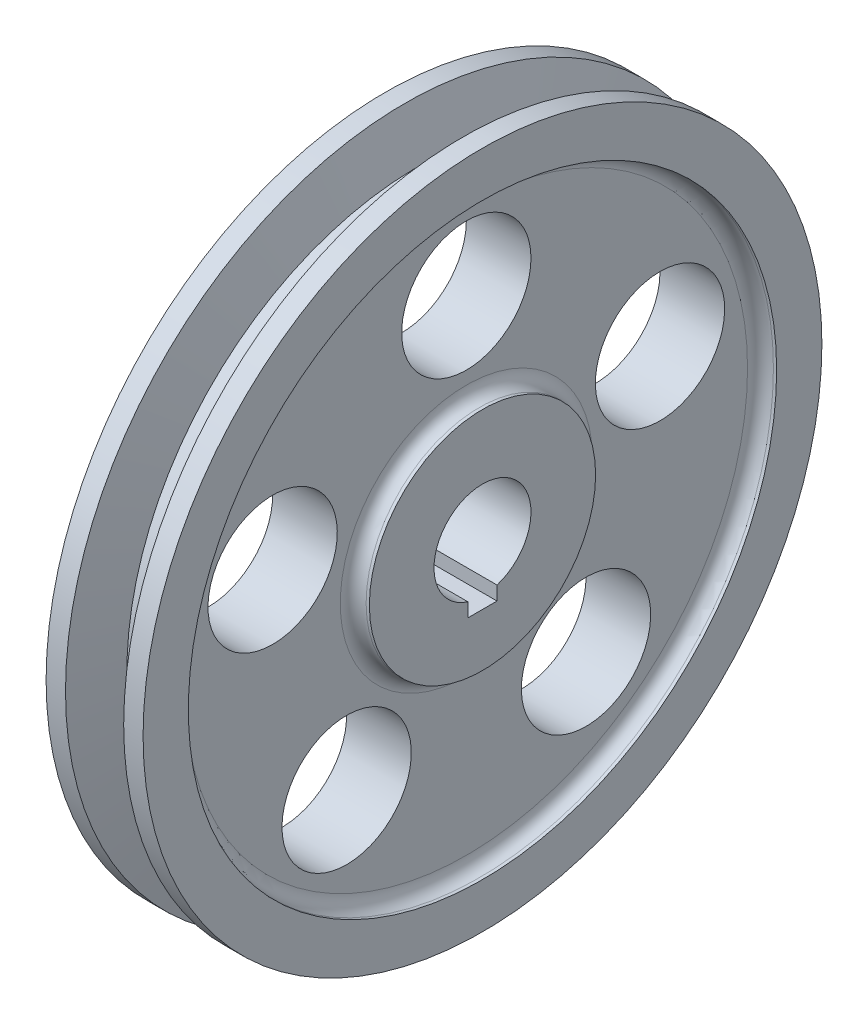
ISO-10303-21;
HEADER;
FILE_DESCRIPTION(('STEP AP214'),'2;1');
FILE_NAME('part.step','',(''),(''),'','','');
FILE_SCHEMA(('AUTOMOTIVE_DESIGN { 1 0 10303 214 1 1 1 1 }'));
ENDSEC;
DATA;
#1=APPLICATION_CONTEXT('core data for automotive mechanical design processes');
#2=APPLICATION_PROTOCOL_DEFINITION('international standard','automotive_design',2000,#1);
#3=PRODUCT_CONTEXT('',#1,'mechanical');
#4=PRODUCT('Part','Part','',(#3));
#5=PRODUCT_RELATED_PRODUCT_CATEGORY('part','',(#4));
#6=PRODUCT_DEFINITION_FORMATION('','',#4);
#7=PRODUCT_DEFINITION_CONTEXT('part definition',#1,'design');
#8=PRODUCT_DEFINITION('design','',#6,#7);
#9=PRODUCT_DEFINITION_SHAPE('','',#8);
#10=(LENGTH_UNIT() NAMED_UNIT(*) SI_UNIT(.MILLI.,.METRE.));
#11=(NAMED_UNIT(*) PLANE_ANGLE_UNIT() SI_UNIT($,.RADIAN.));
#12=(NAMED_UNIT(*) SI_UNIT($,.STERADIAN.) SOLID_ANGLE_UNIT());
#13=UNCERTAINTY_MEASURE_WITH_UNIT(LENGTH_MEASURE(1.E-05),#10,'distance_accuracy_value','');
#14=(GEOMETRIC_REPRESENTATION_CONTEXT(3) GLOBAL_UNCERTAINTY_ASSIGNED_CONTEXT((#13)) GLOBAL_UNIT_ASSIGNED_CONTEXT((#10,
#11,#12)) REPRESENTATION_CONTEXT('',''));
#15=CARTESIAN_POINT('',(0.,0.,0.));
#16=DIRECTION('',(0.,0.,1.));
#17=DIRECTION('',(1.,0.,0.));
#18=AXIS2_PLACEMENT_3D('',#15,#16,#17);
#19=CARTESIAN_POINT('',(-7.5,7.5,0.));
#20=DIRECTION('',(-1.,0.,0.));
#21=DIRECTION('',(0.,0.,1.));
#22=AXIS2_PLACEMENT_3D('',#19,#20,#21);
#23=PLANE('',#22);
#24=DIRECTION('',(0.,-1.,0.));
#25=VECTOR('',#24,1.);
#26=CARTESIAN_POINT('',(-7.5,-7.,2.25));
#27=LINE('',#26,#25);
#28=CARTESIAN_POINT('',(-7.5,-7.15454401062709,2.25));
#29=VERTEX_POINT('',#28);
#30=CARTESIAN_POINT('',(-7.5,-9.3,2.25));
#31=VERTEX_POINT('',#30);
#32=EDGE_CURVE('E50',#29,#31,#27,.T.);
#33=ORIENTED_EDGE('',*,*,#32,.T.);
#34=DIRECTION('',(0.,0.,-1.));
#35=VECTOR('',#34,1.);
#36=CARTESIAN_POINT('',(-7.5,-9.3,2.25));
#37=LINE('',#36,#35);
#38=CARTESIAN_POINT('',(-7.5,-9.3,-2.25));
#39=VERTEX_POINT('',#38);
#40=EDGE_CURVE('E74',#31,#39,#37,.T.);
#41=ORIENTED_EDGE('',*,*,#40,.T.);
#42=DIRECTION('',(0.,1.,0.));
#43=VECTOR('',#42,1.);
#44=CARTESIAN_POINT('',(-7.5,-7.,-2.25));
#45=LINE('',#44,#43);
#46=CARTESIAN_POINT('',(-7.5,-7.15454401062709,-2.25));
#47=VERTEX_POINT('',#46);
#48=EDGE_CURVE('E71',#39,#47,#45,.T.);
#49=ORIENTED_EDGE('',*,*,#48,.T.);
#50=CARTESIAN_POINT('',(-7.5,0.,0.));
#51=DIRECTION('',(1.,0.,0.));
#52=DIRECTION('',(0.,0.,-1.));
#53=AXIS2_PLACEMENT_3D('',#50,#51,#52);
#54=CIRCLE('',#53,7.5);
#55=EDGE_CURVE('E37',#47,#29,#54,.T.);
#56=ORIENTED_EDGE('',*,*,#55,.T.);
#57=EDGE_LOOP('',(#33,#41,#49,#56));
#58=FACE_BOUND('',#57,.T.);
#59=CARTESIAN_POINT('',(-7.5,0.,0.));
#60=DIRECTION('',(1.,0.,0.));
#61=DIRECTION('',(0.,0.,-1.));
#62=AXIS2_PLACEMENT_3D('',#59,#60,#61);
#63=CIRCLE('',#62,17.5);
#64=CARTESIAN_POINT('',(-7.5,0.,-17.5));
#65=VERTEX_POINT('',#64);
#66=EDGE_CURVE('E123',#65,#65,#63,.T.);
#67=ORIENTED_EDGE('',*,*,#66,.F.);
#68=EDGE_LOOP('',(#67));
#69=FACE_BOUND('',#68,.T.);
#70=ADVANCED_FACE('F30',(#58,#69),#23,.T.);
#71=CARTESIAN_POINT('',(25.8640372963672,0.,0.));
#72=DIRECTION('',(1.,0.,0.));
#73=DIRECTION('',(0.,0.,-1.));
#74=AXIS2_PLACEMENT_3D('',#71,#72,#73);
#75=CYLINDRICAL_SURFACE('',#74,7.5);
#76=DIRECTION('',(1.,0.,0.));
#77=VECTOR('',#76,1.);
#78=CARTESIAN_POINT('',(25.8640372963672,-7.15454401062709,2.25));
#79=LINE('',#78,#77);
#80=CARTESIAN_POINT('',(7.5,-7.15454401062709,2.25));
#81=VERTEX_POINT('',#80);
#82=EDGE_CURVE('E93',#29,#81,#79,.T.);
#83=ORIENTED_EDGE('',*,*,#82,.F.);
#84=ORIENTED_EDGE('',*,*,#55,.F.);
#85=DIRECTION('',(1.,0.,0.));
#86=VECTOR('',#85,1.);
#87=CARTESIAN_POINT('',(25.8640372963672,-7.15454401062709,-2.25));
#88=LINE('',#87,#86);
#89=CARTESIAN_POINT('',(7.5,-7.15454401062709,-2.25));
#90=VERTEX_POINT('',#89);
#91=EDGE_CURVE('E90',#90,#47,#88,.F.);
#92=ORIENTED_EDGE('',*,*,#91,.F.);
#93=CARTESIAN_POINT('',(7.5,0.,0.));
#94=DIRECTION('',(1.,0.,0.));
#95=DIRECTION('',(0.,0.,-1.));
#96=AXIS2_PLACEMENT_3D('',#93,#94,#95);
#97=CIRCLE('',#96,7.5);
#98=EDGE_CURVE('E179',#90,#81,#97,.T.);
#99=ORIENTED_EDGE('',*,*,#98,.T.);
#100=EDGE_LOOP('',(#83,#84,#92,#99));
#101=FACE_BOUND('',#100,.T.);
#102=ADVANCED_FACE('F184',(#101),#75,.F.);
#103=CARTESIAN_POINT('',(7.5,7.5,0.));
#104=DIRECTION('',(1.,0.,0.));
#105=DIRECTION('',(0.,0.,-1.));
#106=AXIS2_PLACEMENT_3D('',#103,#104,#105);
#107=PLANE('',#106);
#108=DIRECTION('',(0.,-1.,0.));
#109=VECTOR('',#108,1.);
#110=CARTESIAN_POINT('',(7.5,7.5,2.25));
#111=LINE('',#110,#109);
#112=CARTESIAN_POINT('',(7.5,-9.3,2.25));
#113=VERTEX_POINT('',#112);
#114=EDGE_CURVE('E11',#81,#113,#111,.T.);
#115=ORIENTED_EDGE('',*,*,#114,.F.);
#116=ORIENTED_EDGE('',*,*,#98,.F.);
#117=DIRECTION('',(0.,1.,0.));
#118=VECTOR('',#117,1.);
#119=CARTESIAN_POINT('',(7.5,-7.,-2.25));
#120=LINE('',#119,#118);
#121=CARTESIAN_POINT('',(7.5,-9.3,-2.25));
#122=VERTEX_POINT('',#121);
#123=EDGE_CURVE('E83',#122,#90,#120,.T.);
#124=ORIENTED_EDGE('',*,*,#123,.F.);
#125=DIRECTION('',(0.,0.,-1.));
#126=VECTOR('',#125,1.);
#127=CARTESIAN_POINT('',(7.5,-9.3,2.25));
#128=LINE('',#127,#126);
#129=EDGE_CURVE('E85',#113,#122,#128,.T.);
#130=ORIENTED_EDGE('',*,*,#129,.F.);
#131=EDGE_LOOP('',(#115,#116,#124,#130));
#132=FACE_BOUND('',#131,.T.);
#133=CARTESIAN_POINT('',(7.5,0.,0.));
#134=DIRECTION('',(1.,0.,0.));
#135=DIRECTION('',(0.,0.,-1.));
#136=AXIS2_PLACEMENT_3D('',#133,#134,#135);
#137=CIRCLE('',#136,17.5);
#138=CARTESIAN_POINT('',(7.5,0.,-17.5));
#139=VERTEX_POINT('',#138);
#140=EDGE_CURVE('E176',#139,#139,#137,.T.);
#141=ORIENTED_EDGE('',*,*,#140,.T.);
#142=EDGE_LOOP('',(#141));
#143=FACE_BOUND('',#142,.T.);
#144=ADVANCED_FACE('F187',(#132,#143),#107,.T.);
#145=CARTESIAN_POINT('',(25.8640372963672,0.,0.));
#146=DIRECTION('',(1.,0.,0.));
#147=DIRECTION('',(0.,0.,-1.));
#148=AXIS2_PLACEMENT_3D('',#145,#146,#147);
#149=CYLINDRICAL_SURFACE('',#148,17.5);
#150=CARTESIAN_POINT('',(7.,0.,0.));
#151=DIRECTION('',(1.,0.,0.));
#152=DIRECTION('',(0.,0.,-1.));
#153=AXIS2_PLACEMENT_3D('',#150,#151,#152);
#154=CIRCLE('',#153,17.5);
#155=CARTESIAN_POINT('',(7.,0.,-17.5));
#156=VERTEX_POINT('',#155);
#157=EDGE_CURVE('E173',#156,#156,#154,.T.);
#158=ORIENTED_EDGE('',*,*,#157,.T.);
#159=EDGE_LOOP('',(#158));
#160=FACE_BOUND('',#159,.T.);
#161=ORIENTED_EDGE('',*,*,#140,.F.);
#162=EDGE_LOOP('',(#161));
#163=FACE_BOUND('',#162,.T.);
#164=ADVANCED_FACE('F207',(#160,#163),#149,.T.);
#165=CARTESIAN_POINT('',(7.,0.,0.));
#166=DIRECTION('',(1.,0.,0.));
#167=DIRECTION('',(0.,0.,-1.));
#168=AXIS2_PLACEMENT_3D('',#165,#166,#167);
#169=TOROIDAL_SURFACE('',#168,19.5,2.);
#170=CARTESIAN_POINT('',(5.,0.,0.));
#171=DIRECTION('',(1.,0.,0.));
#172=DIRECTION('',(0.,0.,-1.));
#173=AXIS2_PLACEMENT_3D('',#170,#171,#172);
#174=CIRCLE('',#173,19.5);
#175=CARTESIAN_POINT('',(5.,0.,-19.5));
#176=VERTEX_POINT('',#175);
#177=EDGE_CURVE('E170',#176,#176,#174,.T.);
#178=ORIENTED_EDGE('',*,*,#177,.T.);
#179=EDGE_LOOP('',(#178));
#180=FACE_BOUND('',#179,.T.);
#181=ORIENTED_EDGE('',*,*,#157,.F.);
#182=EDGE_LOOP('',(#181));
#183=FACE_BOUND('',#182,.T.);
#184=ADVANCED_FACE('F212',(#180,#183),#169,.F.);
#185=CARTESIAN_POINT('',(5.,19.5,0.));
#186=DIRECTION('',(1.,0.,0.));
#187=DIRECTION('',(0.,0.,-1.));
#188=AXIS2_PLACEMENT_3D('',#185,#186,#187);
#189=PLANE('',#188);
#190=CARTESIAN_POINT('',(5.,9.73403532281119,29.9582802632972));
#191=DIRECTION('',(1.,0.,0.));
#192=DIRECTION('',(0.,0.95105651629515,-0.309016994374958));
#193=AXIS2_PLACEMENT_3D('',#190,#191,#192);
#194=CIRCLE('',#193,10.);
#195=CARTESIAN_POINT('',(5.,19.2446004857627,26.8681103195476));
#196=VERTEX_POINT('',#195);
#197=EDGE_CURVE('E95',#196,#196,#194,.T.);
#198=ORIENTED_EDGE('',*,*,#197,.F.);
#199=EDGE_LOOP('',(#198));
#200=FACE_BOUND('',#199,.T.);
#201=CARTESIAN_POINT('',(5.,-25.4840353228107,18.5152354472131));
#202=DIRECTION('',(1.,0.,0.));
#203=DIRECTION('',(0.,0.58778525229248,0.809016994374942));
#204=AXIS2_PLACEMENT_3D('',#201,#202,#203);
#205=CIRCLE('',#204,10.);
#206=CARTESIAN_POINT('',(5.,-19.6061827998859,26.6054053909626));
#207=VERTEX_POINT('',#206);
#208=EDGE_CURVE('E99',#207,#207,#205,.T.);
#209=ORIENTED_EDGE('',*,*,#208,.F.);
#210=EDGE_LOOP('',(#209));
#211=FACE_BOUND('',#210,.T.);
#212=CARTESIAN_POINT('',(5.,-25.4840353228109,-18.5152354472128));
#213=DIRECTION('',(1.,0.,0.));
#214=DIRECTION('',(0.,-0.587785252292469,0.809016994374951));
#215=AXIS2_PLACEMENT_3D('',#212,#213,#214);
#216=CIRCLE('',#215,10.);
#217=CARTESIAN_POINT('',(5.,-31.3618878457356,-10.4250655034632));
#218=VERTEX_POINT('',#217);
#219=EDGE_CURVE('E105',#218,#218,#216,.T.);
#220=ORIENTED_EDGE('',*,*,#219,.F.);
#221=EDGE_LOOP('',(#220));
#222=FACE_BOUND('',#221,.T.);
#223=CARTESIAN_POINT('',(5.,9.73403532281076,-29.9582802632974));
#224=DIRECTION('',(1.,0.,0.));
#225=DIRECTION('',(0.,-0.951056516295155,-0.309016994374945));
#226=AXIS2_PLACEMENT_3D('',#223,#224,#225);
#227=CIRCLE('',#226,10.);
#228=CARTESIAN_POINT('',(5.,0.223470159859206,-33.0484502070468));
#229=VERTEX_POINT('',#228);
#230=EDGE_CURVE('E111',#229,#229,#227,.T.);
#231=ORIENTED_EDGE('',*,*,#230,.F.);
#232=EDGE_LOOP('',(#231));
#233=FACE_BOUND('',#232,.T.);
#234=CARTESIAN_POINT('',(5.,31.5,0.));
#235=DIRECTION('',(1.,0.,0.));
#236=DIRECTION('',(0.,0.,-1.));
#237=AXIS2_PLACEMENT_3D('',#234,#235,#236);
#238=CIRCLE('',#237,10.);
#239=CARTESIAN_POINT('',(5.,31.5,-10.));
#240=VERTEX_POINT('',#239);
#241=EDGE_CURVE('E117',#240,#240,#238,.T.);
#242=ORIENTED_EDGE('',*,*,#241,.F.);
#243=EDGE_LOOP('',(#242));
#244=FACE_BOUND('',#243,.T.);
#245=CARTESIAN_POINT('',(5.,0.,0.));
#246=DIRECTION('',(1.,0.,0.));
#247=DIRECTION('',(0.,0.,-1.));
#248=AXIS2_PLACEMENT_3D('',#245,#246,#247);
#249=CIRCLE('',#248,43.5);
#250=CARTESIAN_POINT('',(5.,0.,-43.5));
#251=VERTEX_POINT('',#250);
#252=EDGE_CURVE('E167',#251,#251,#249,.T.);
#253=ORIENTED_EDGE('',*,*,#252,.T.);
#254=EDGE_LOOP('',(#253));
#255=FACE_BOUND('',#254,.T.);
#256=ORIENTED_EDGE('',*,*,#177,.F.);
#257=EDGE_LOOP('',(#256));
#258=FACE_BOUND('',#257,.T.);
#259=ADVANCED_FACE('F216',(#200,#211,#222,#233,#244,#255,#258),#189,.T.);
#260=CARTESIAN_POINT('',(7.,0.,0.));
#261=DIRECTION('',(1.,0.,0.));
#262=DIRECTION('',(0.,0.,-1.));
#263=AXIS2_PLACEMENT_3D('',#260,#261,#262);
#264=TOROIDAL_SURFACE('',#263,43.5,2.);
#265=CARTESIAN_POINT('',(7.,0.,0.));
#266=DIRECTION('',(1.,0.,0.));
#267=DIRECTION('',(0.,0.,-1.));
#268=AXIS2_PLACEMENT_3D('',#265,#266,#267);
#269=CIRCLE('',#268,45.5);
#270=CARTESIAN_POINT('',(7.,0.,-45.5));
#271=VERTEX_POINT('',#270);
#272=EDGE_CURVE('E164',#271,#271,#269,.T.);
#273=ORIENTED_EDGE('',*,*,#272,.T.);
#274=EDGE_LOOP('',(#273));
#275=FACE_BOUND('',#274,.T.);
#276=ORIENTED_EDGE('',*,*,#252,.F.);
#277=EDGE_LOOP('',(#276));
#278=FACE_BOUND('',#277,.T.);
#279=ADVANCED_FACE('F220',(#275,#278),#264,.F.);
#280=CARTESIAN_POINT('',(25.8640372963672,0.,0.));
#281=DIRECTION('',(1.,0.,0.));
#282=DIRECTION('',(0.,0.,-1.));
#283=AXIS2_PLACEMENT_3D('',#280,#281,#282);
#284=CYLINDRICAL_SURFACE('',#283,45.5);
#285=CARTESIAN_POINT('',(7.5,0.,0.));
#286=DIRECTION('',(1.,0.,0.));
#287=DIRECTION('',(0.,0.,-1.));
#288=AXIS2_PLACEMENT_3D('',#285,#286,#287);
#289=CIRCLE('',#288,45.5);
#290=CARTESIAN_POINT('',(7.5,0.,-45.5));
#291=VERTEX_POINT('',#290);
#292=EDGE_CURVE('E161',#291,#291,#289,.T.);
#293=ORIENTED_EDGE('',*,*,#292,.T.);
#294=EDGE_LOOP('',(#293));
#295=FACE_BOUND('',#294,.T.);
#296=ORIENTED_EDGE('',*,*,#272,.F.);
#297=EDGE_LOOP('',(#296));
#298=FACE_BOUND('',#297,.T.);
#299=ADVANCED_FACE('F224',(#295,#298),#284,.F.);
#300=CARTESIAN_POINT('',(7.5,45.5,0.));
#301=DIRECTION('',(1.,0.,0.));
#302=DIRECTION('',(0.,0.,-1.));
#303=AXIS2_PLACEMENT_3D('',#300,#301,#302);
#304=PLANE('',#303);
#305=CARTESIAN_POINT('',(7.5,0.,0.));
#306=DIRECTION('',(1.,0.,0.));
#307=DIRECTION('',(0.,0.,-1.));
#308=AXIS2_PLACEMENT_3D('',#305,#306,#307);
#309=CIRCLE('',#308,52.5);
#310=CARTESIAN_POINT('',(7.5,0.,-52.5));
#311=VERTEX_POINT('',#310);
#312=EDGE_CURVE('E158',#311,#311,#309,.T.);
#313=ORIENTED_EDGE('',*,*,#312,.T.);
#314=EDGE_LOOP('',(#313));
#315=FACE_BOUND('',#314,.T.);
#316=ORIENTED_EDGE('',*,*,#292,.F.);
#317=EDGE_LOOP('',(#316));
#318=FACE_BOUND('',#317,.T.);
#319=ADVANCED_FACE('F228',(#315,#318),#304,.T.);
#320=CARTESIAN_POINT('',(25.8640372963672,0.,0.));
#321=DIRECTION('',(1.,0.,0.));
#322=DIRECTION('',(0.,0.,-1.));
#323=AXIS2_PLACEMENT_3D('',#320,#321,#322);
#324=CYLINDRICAL_SURFACE('',#323,52.5);
#325=CARTESIAN_POINT('',(4.5,0.,0.));
#326=DIRECTION('',(1.,0.,0.));
#327=DIRECTION('',(0.,0.,-1.));
#328=AXIS2_PLACEMENT_3D('',#325,#326,#327);
#329=CIRCLE('',#328,52.5);
#330=CARTESIAN_POINT('',(4.5,0.,-52.5));
#331=VERTEX_POINT('',#330);
#332=EDGE_CURVE('E155',#331,#331,#329,.T.);
#333=ORIENTED_EDGE('',*,*,#332,.T.);
#334=EDGE_LOOP('',(#333));
#335=FACE_BOUND('',#334,.T.);
#336=ORIENTED_EDGE('',*,*,#312,.F.);
#337=EDGE_LOOP('',(#336));
#338=FACE_BOUND('',#337,.T.);
#339=ADVANCED_FACE('F232',(#335,#338),#324,.T.);
#340=CARTESIAN_POINT('',(4.5,0.,0.));
#341=DIRECTION('',(1.,0.,0.));
#342=DIRECTION('',(0.,0.,-1.));
#343=AXIS2_PLACEMENT_3D('',#340,#341,#342);
#344=CONICAL_SURFACE('',#343,52.5,1.31019393504756);
#345=CARTESIAN_POINT('',(2.5,0.,0.));
#346=DIRECTION('',(1.,0.,0.));
#347=DIRECTION('',(0.,0.,-1.));
#348=AXIS2_PLACEMENT_3D('',#345,#346,#347);
#349=CIRCLE('',#348,45.);
#350=CARTESIAN_POINT('',(2.5,0.,-45.));
#351=VERTEX_POINT('',#350);
#352=EDGE_CURVE('E152',#351,#351,#349,.T.);
#353=ORIENTED_EDGE('',*,*,#352,.T.);
#354=EDGE_LOOP('',(#353));
#355=FACE_BOUND('',#354,.T.);
#356=ORIENTED_EDGE('',*,*,#332,.F.);
#357=EDGE_LOOP('',(#356));
#358=FACE_BOUND('',#357,.T.);
#359=ADVANCED_FACE('F236',(#355,#358),#344,.T.);
#360=CARTESIAN_POINT('',(25.8640372963672,0.,0.));
#361=DIRECTION('',(1.,0.,0.));
#362=DIRECTION('',(0.,0.,-1.));
#363=AXIS2_PLACEMENT_3D('',#360,#361,#362);
#364=CYLINDRICAL_SURFACE('',#363,45.);
#365=CARTESIAN_POINT('',(-2.5,0.,0.));
#366=DIRECTION('',(1.,0.,0.));
#367=DIRECTION('',(0.,0.,-1.));
#368=AXIS2_PLACEMENT_3D('',#365,#366,#367);
#369=CIRCLE('',#368,45.);
#370=CARTESIAN_POINT('',(-2.5,0.,-45.));
#371=VERTEX_POINT('',#370);
#372=EDGE_CURVE('E149',#371,#371,#369,.T.);
#373=ORIENTED_EDGE('',*,*,#372,.T.);
#374=EDGE_LOOP('',(#373));
#375=FACE_BOUND('',#374,.T.);
#376=ORIENTED_EDGE('',*,*,#352,.F.);
#377=EDGE_LOOP('',(#376));
#378=FACE_BOUND('',#377,.T.);
#379=ADVANCED_FACE('F240',(#375,#378),#364,.T.);
#380=CARTESIAN_POINT('',(-2.5,0.,0.));
#381=DIRECTION('',(-1.,0.,0.));
#382=DIRECTION('',(0.,0.,1.));
#383=AXIS2_PLACEMENT_3D('',#380,#381,#382);
#384=CONICAL_SURFACE('',#383,45.,1.31019393504756);
#385=CARTESIAN_POINT('',(-4.5,0.,0.));
#386=DIRECTION('',(1.,0.,0.));
#387=DIRECTION('',(0.,0.,-1.));
#388=AXIS2_PLACEMENT_3D('',#385,#386,#387);
#389=CIRCLE('',#388,52.5);
#390=CARTESIAN_POINT('',(-4.5,0.,-52.5));
#391=VERTEX_POINT('',#390);
#392=EDGE_CURVE('E146',#391,#391,#389,.T.);
#393=ORIENTED_EDGE('',*,*,#392,.T.);
#394=EDGE_LOOP('',(#393));
#395=FACE_BOUND('',#394,.T.);
#396=ORIENTED_EDGE('',*,*,#372,.F.);
#397=EDGE_LOOP('',(#396));
#398=FACE_BOUND('',#397,.T.);
#399=ADVANCED_FACE('F244',(#395,#398),#384,.T.);
#400=CARTESIAN_POINT('',(25.8640372963672,0.,0.));
#401=DIRECTION('',(1.,0.,0.));
#402=DIRECTION('',(0.,0.,-1.));
#403=AXIS2_PLACEMENT_3D('',#400,#401,#402);
#404=CYLINDRICAL_SURFACE('',#403,52.5);
#405=CARTESIAN_POINT('',(-7.5,0.,0.));
#406=DIRECTION('',(1.,0.,0.));
#407=DIRECTION('',(0.,0.,-1.));
#408=AXIS2_PLACEMENT_3D('',#405,#406,#407);
#409=CIRCLE('',#408,52.5);
#410=CARTESIAN_POINT('',(-7.5,0.,-52.5));
#411=VERTEX_POINT('',#410);
#412=EDGE_CURVE('E143',#411,#411,#409,.T.);
#413=ORIENTED_EDGE('',*,*,#412,.T.);
#414=EDGE_LOOP('',(#413));
#415=FACE_BOUND('',#414,.T.);
#416=ORIENTED_EDGE('',*,*,#392,.F.);
#417=EDGE_LOOP('',(#416));
#418=FACE_BOUND('',#417,.T.);
#419=ADVANCED_FACE('F248',(#415,#418),#404,.T.);
#420=CARTESIAN_POINT('',(-7.5,45.5,0.));
#421=DIRECTION('',(-1.,0.,0.));
#422=DIRECTION('',(0.,0.,1.));
#423=AXIS2_PLACEMENT_3D('',#420,#421,#422);
#424=PLANE('',#423);
#425=CARTESIAN_POINT('',(-7.5,0.,0.));
#426=DIRECTION('',(1.,0.,0.));
#427=DIRECTION('',(0.,0.,-1.));
#428=AXIS2_PLACEMENT_3D('',#425,#426,#427);
#429=CIRCLE('',#428,45.5);
#430=CARTESIAN_POINT('',(-7.5,0.,-45.5));
#431=VERTEX_POINT('',#430);
#432=EDGE_CURVE('E140',#431,#431,#429,.T.);
#433=ORIENTED_EDGE('',*,*,#432,.T.);
#434=EDGE_LOOP('',(#433));
#435=FACE_BOUND('',#434,.T.);
#436=ORIENTED_EDGE('',*,*,#412,.F.);
#437=EDGE_LOOP('',(#436));
#438=FACE_BOUND('',#437,.T.);
#439=ADVANCED_FACE('F252',(#435,#438),#424,.T.);
#440=CARTESIAN_POINT('',(25.8640372963672,0.,0.));
#441=DIRECTION('',(1.,0.,0.));
#442=DIRECTION('',(0.,0.,-1.));
#443=AXIS2_PLACEMENT_3D('',#440,#441,#442);
#444=CYLINDRICAL_SURFACE('',#443,45.5);
#445=CARTESIAN_POINT('',(-7.,0.,0.));
#446=DIRECTION('',(1.,0.,0.));
#447=DIRECTION('',(0.,0.,-1.));
#448=AXIS2_PLACEMENT_3D('',#445,#446,#447);
#449=CIRCLE('',#448,45.5);
#450=CARTESIAN_POINT('',(-7.,0.,-45.5));
#451=VERTEX_POINT('',#450);
#452=EDGE_CURVE('E137',#451,#451,#449,.T.);
#453=ORIENTED_EDGE('',*,*,#452,.T.);
#454=EDGE_LOOP('',(#453));
#455=FACE_BOUND('',#454,.T.);
#456=ORIENTED_EDGE('',*,*,#432,.F.);
#457=EDGE_LOOP('',(#456));
#458=FACE_BOUND('',#457,.T.);
#459=ADVANCED_FACE('F256',(#455,#458),#444,.F.);
#460=CARTESIAN_POINT('',(-7.,0.,0.));
#461=DIRECTION('',(1.,0.,0.));
#462=DIRECTION('',(0.,0.,-1.));
#463=AXIS2_PLACEMENT_3D('',#460,#461,#462);
#464=TOROIDAL_SURFACE('',#463,43.5,2.);
#465=CARTESIAN_POINT('',(-5.,0.,0.));
#466=DIRECTION('',(1.,0.,0.));
#467=DIRECTION('',(0.,0.,-1.));
#468=AXIS2_PLACEMENT_3D('',#465,#466,#467);
#469=CIRCLE('',#468,43.5);
#470=CARTESIAN_POINT('',(-5.,0.,-43.5));
#471=VERTEX_POINT('',#470);
#472=EDGE_CURVE('E134',#471,#471,#469,.T.);
#473=ORIENTED_EDGE('',*,*,#472,.T.);
#474=EDGE_LOOP('',(#473));
#475=FACE_BOUND('',#474,.T.);
#476=ORIENTED_EDGE('',*,*,#452,.F.);
#477=EDGE_LOOP('',(#476));
#478=FACE_BOUND('',#477,.T.);
#479=ADVANCED_FACE('F260',(#475,#478),#464,.F.);
#480=CARTESIAN_POINT('',(-5.,19.5,0.));
#481=DIRECTION('',(-1.,0.,0.));
#482=DIRECTION('',(0.,0.,1.));
#483=AXIS2_PLACEMENT_3D('',#480,#481,#482);
#484=PLANE('',#483);
#485=CARTESIAN_POINT('',(-5.,9.73403532281119,29.9582802632972));
#486=DIRECTION('',(1.,0.,0.));
#487=DIRECTION('',(0.,0.95105651629515,-0.309016994374958));
#488=AXIS2_PLACEMENT_3D('',#485,#486,#487);
#489=CIRCLE('',#488,10.);
#490=CARTESIAN_POINT('',(-5.,19.2446004857627,26.8681103195476));
#491=VERTEX_POINT('',#490);
#492=EDGE_CURVE('E96',#491,#491,#489,.T.);
#493=ORIENTED_EDGE('',*,*,#492,.T.);
#494=EDGE_LOOP('',(#493));
#495=FACE_BOUND('',#494,.T.);
#496=CARTESIAN_POINT('',(-5.,-25.4840353228107,18.5152354472131));
#497=DIRECTION('',(1.,0.,0.));
#498=DIRECTION('',(0.,0.58778525229248,0.809016994374942));
#499=AXIS2_PLACEMENT_3D('',#496,#497,#498);
#500=CIRCLE('',#499,10.);
#501=CARTESIAN_POINT('',(-5.,-19.6061827998859,26.6054053909626));
#502=VERTEX_POINT('',#501);
#503=EDGE_CURVE('E102',#502,#502,#500,.T.);
#504=ORIENTED_EDGE('',*,*,#503,.T.);
#505=EDGE_LOOP('',(#504));
#506=FACE_BOUND('',#505,.T.);
#507=CARTESIAN_POINT('',(-5.,-25.4840353228109,-18.5152354472128));
#508=DIRECTION('',(1.,0.,0.));
#509=DIRECTION('',(0.,-0.587785252292469,0.809016994374951));
#510=AXIS2_PLACEMENT_3D('',#507,#508,#509);
#511=CIRCLE('',#510,10.);
#512=CARTESIAN_POINT('',(-5.,-31.3618878457356,-10.4250655034632));
#513=VERTEX_POINT('',#512);
#514=EDGE_CURVE('E108',#513,#513,#511,.T.);
#515=ORIENTED_EDGE('',*,*,#514,.T.);
#516=EDGE_LOOP('',(#515));
#517=FACE_BOUND('',#516,.T.);
#518=CARTESIAN_POINT('',(-5.,9.73403532281076,-29.9582802632974));
#519=DIRECTION('',(1.,0.,0.));
#520=DIRECTION('',(0.,-0.951056516295155,-0.309016994374945));
#521=AXIS2_PLACEMENT_3D('',#518,#519,#520);
#522=CIRCLE('',#521,10.);
#523=CARTESIAN_POINT('',(-5.,0.223470159859206,-33.0484502070468));
#524=VERTEX_POINT('',#523);
#525=EDGE_CURVE('E114',#524,#524,#522,.T.);
#526=ORIENTED_EDGE('',*,*,#525,.T.);
#527=EDGE_LOOP('',(#526));
#528=FACE_BOUND('',#527,.T.);
#529=CARTESIAN_POINT('',(-5.,31.5,0.));
#530=DIRECTION('',(1.,0.,0.));
#531=DIRECTION('',(0.,0.,-1.));
#532=AXIS2_PLACEMENT_3D('',#529,#530,#531);
#533=CIRCLE('',#532,10.);
#534=CARTESIAN_POINT('',(-5.,31.5,-10.));
#535=VERTEX_POINT('',#534);
#536=EDGE_CURVE('E120',#535,#535,#533,.T.);
#537=ORIENTED_EDGE('',*,*,#536,.T.);
#538=EDGE_LOOP('',(#537));
#539=FACE_BOUND('',#538,.T.);
#540=CARTESIAN_POINT('',(-5.,0.,0.));
#541=DIRECTION('',(1.,0.,0.));
#542=DIRECTION('',(0.,0.,-1.));
#543=AXIS2_PLACEMENT_3D('',#540,#541,#542);
#544=CIRCLE('',#543,19.5);
#545=CARTESIAN_POINT('',(-5.,0.,-19.5));
#546=VERTEX_POINT('',#545);
#547=EDGE_CURVE('E131',#546,#546,#544,.T.);
#548=ORIENTED_EDGE('',*,*,#547,.T.);
#549=EDGE_LOOP('',(#548));
#550=FACE_BOUND('',#549,.T.);
#551=ORIENTED_EDGE('',*,*,#472,.F.);
#552=EDGE_LOOP('',(#551));
#553=FACE_BOUND('',#552,.T.);
#554=ADVANCED_FACE('F264',(#495,#506,#517,#528,#539,#550,#553),#484,.T.);
#555=CARTESIAN_POINT('',(-7.,0.,0.));
#556=DIRECTION('',(1.,0.,0.));
#557=DIRECTION('',(0.,0.,-1.));
#558=AXIS2_PLACEMENT_3D('',#555,#556,#557);
#559=TOROIDAL_SURFACE('',#558,19.5,2.);
#560=CARTESIAN_POINT('',(-7.,0.,0.));
#561=DIRECTION('',(1.,0.,0.));
#562=DIRECTION('',(0.,0.,-1.));
#563=AXIS2_PLACEMENT_3D('',#560,#561,#562);
#564=CIRCLE('',#563,17.5);
#565=CARTESIAN_POINT('',(-7.,0.,-17.5));
#566=VERTEX_POINT('',#565);
#567=EDGE_CURVE('E128',#566,#566,#564,.T.);
#568=ORIENTED_EDGE('',*,*,#567,.T.);
#569=EDGE_LOOP('',(#568));
#570=FACE_BOUND('',#569,.T.);
#571=ORIENTED_EDGE('',*,*,#547,.F.);
#572=EDGE_LOOP('',(#571));
#573=FACE_BOUND('',#572,.T.);
#574=ADVANCED_FACE('F268',(#570,#573),#559,.F.);
#575=CARTESIAN_POINT('',(25.8640372963672,0.,0.));
#576=DIRECTION('',(1.,0.,0.));
#577=DIRECTION('',(0.,0.,-1.));
#578=AXIS2_PLACEMENT_3D('',#575,#576,#577);
#579=CYLINDRICAL_SURFACE('',#578,17.5);
#580=ORIENTED_EDGE('',*,*,#66,.T.);
#581=EDGE_LOOP('',(#580));
#582=FACE_BOUND('',#581,.T.);
#583=ORIENTED_EDGE('',*,*,#567,.F.);
#584=EDGE_LOOP('',(#583));
#585=FACE_BOUND('',#584,.T.);
#586=ADVANCED_FACE('F272',(#582,#585),#579,.T.);
#587=CARTESIAN_POINT('',(-5.,31.5,0.));
#588=DIRECTION('',(1.,0.,0.));
#589=DIRECTION('',(0.,0.,-1.));
#590=AXIS2_PLACEMENT_3D('',#587,#588,#589);
#591=CYLINDRICAL_SURFACE('',#590,10.);
#592=ORIENTED_EDGE('',*,*,#536,.F.);
#593=EDGE_LOOP('',(#592));
#594=FACE_BOUND('',#593,.T.);
#595=ORIENTED_EDGE('',*,*,#241,.T.);
#596=EDGE_LOOP('',(#595));
#597=FACE_BOUND('',#596,.T.);
#598=ADVANCED_FACE('F276',(#594,#597),#591,.F.);
#599=CARTESIAN_POINT('',(-5.,9.73403532281076,-29.9582802632974));
#600=DIRECTION('',(1.,0.,0.));
#601=DIRECTION('',(0.,0.,-1.));
#602=AXIS2_PLACEMENT_3D('',#599,#600,#601);
#603=CYLINDRICAL_SURFACE('',#602,10.);
#604=ORIENTED_EDGE('',*,*,#525,.F.);
#605=EDGE_LOOP('',(#604));
#606=FACE_BOUND('',#605,.T.);
#607=ORIENTED_EDGE('',*,*,#230,.T.);
#608=EDGE_LOOP('',(#607));
#609=FACE_BOUND('',#608,.T.);
#610=ADVANCED_FACE('F280',(#606,#609),#603,.F.);
#611=CARTESIAN_POINT('',(-5.,-25.4840353228109,-18.5152354472128));
#612=DIRECTION('',(1.,0.,0.));
#613=DIRECTION('',(0.,0.,-1.));
#614=AXIS2_PLACEMENT_3D('',#611,#612,#613);
#615=CYLINDRICAL_SURFACE('',#614,10.);
#616=ORIENTED_EDGE('',*,*,#514,.F.);
#617=EDGE_LOOP('',(#616));
#618=FACE_BOUND('',#617,.T.);
#619=ORIENTED_EDGE('',*,*,#219,.T.);
#620=EDGE_LOOP('',(#619));
#621=FACE_BOUND('',#620,.T.);
#622=ADVANCED_FACE('F284',(#618,#621),#615,.F.);
#623=CARTESIAN_POINT('',(-5.,-25.4840353228107,18.5152354472131));
#624=DIRECTION('',(1.,0.,0.));
#625=DIRECTION('',(0.,0.,-1.));
#626=AXIS2_PLACEMENT_3D('',#623,#624,#625);
#627=CYLINDRICAL_SURFACE('',#626,10.);
#628=ORIENTED_EDGE('',*,*,#503,.F.);
#629=EDGE_LOOP('',(#628));
#630=FACE_BOUND('',#629,.T.);
#631=ORIENTED_EDGE('',*,*,#208,.T.);
#632=EDGE_LOOP('',(#631));
#633=FACE_BOUND('',#632,.T.);
#634=ADVANCED_FACE('F288',(#630,#633),#627,.F.);
#635=CARTESIAN_POINT('',(-5.,9.73403532281119,29.9582802632972));
#636=DIRECTION('',(1.,0.,0.));
#637=DIRECTION('',(0.,0.,-1.));
#638=AXIS2_PLACEMENT_3D('',#635,#636,#637);
#639=CYLINDRICAL_SURFACE('',#638,10.);
#640=ORIENTED_EDGE('',*,*,#492,.F.);
#641=EDGE_LOOP('',(#640));
#642=FACE_BOUND('',#641,.T.);
#643=ORIENTED_EDGE('',*,*,#197,.T.);
#644=EDGE_LOOP('',(#643));
#645=FACE_BOUND('',#644,.T.);
#646=ADVANCED_FACE('F198',(#642,#645),#639,.F.);
#647=CARTESIAN_POINT('',(-7.5,-7.,2.25));
#648=DIRECTION('',(0.,0.,1.));
#649=DIRECTION('',(1.,0.,0.));
#650=AXIS2_PLACEMENT_3D('',#647,#648,#649);
#651=PLANE('',#650);
#652=ORIENTED_EDGE('',*,*,#82,.T.);
#653=ORIENTED_EDGE('',*,*,#114,.T.);
#654=DIRECTION('',(1.,0.,0.));
#655=VECTOR('',#654,1.);
#656=CARTESIAN_POINT('',(-7.5,-9.3,2.25));
#657=LINE('',#656,#655);
#658=EDGE_CURVE('E44',#31,#113,#657,.T.);
#659=ORIENTED_EDGE('',*,*,#658,.F.);
#660=ORIENTED_EDGE('',*,*,#32,.F.);
#661=EDGE_LOOP('',(#652,#653,#659,#660));
#662=FACE_BOUND('',#661,.T.);
#663=ADVANCED_FACE('F67',(#662),#651,.F.);
#664=CARTESIAN_POINT('',(-7.5,-7.,-2.25));
#665=DIRECTION('',(0.,0.,-1.));
#666=DIRECTION('',(-1.,0.,0.));
#667=AXIS2_PLACEMENT_3D('',#664,#665,#666);
#668=PLANE('',#667);
#669=ORIENTED_EDGE('',*,*,#91,.T.);
#670=ORIENTED_EDGE('',*,*,#48,.F.);
#671=DIRECTION('',(1.,0.,0.));
#672=VECTOR('',#671,1.);
#673=CARTESIAN_POINT('',(-7.5,-9.3,-2.25));
#674=LINE('',#673,#672);
#675=EDGE_CURVE('E70',#39,#122,#674,.T.);
#676=ORIENTED_EDGE('',*,*,#675,.T.);
#677=ORIENTED_EDGE('',*,*,#123,.T.);
#678=EDGE_LOOP('',(#669,#670,#676,#677));
#679=FACE_BOUND('',#678,.T.);
#680=ADVANCED_FACE('F190',(#679),#668,.F.);
#681=CARTESIAN_POINT('',(-7.5,-9.3,2.25));
#682=DIRECTION('',(0.,-1.,0.));
#683=DIRECTION('',(0.,0.,-1.));
#684=AXIS2_PLACEMENT_3D('',#681,#682,#683);
#685=PLANE('',#684);
#686=ORIENTED_EDGE('',*,*,#129,.T.);
#687=ORIENTED_EDGE('',*,*,#675,.F.);
#688=ORIENTED_EDGE('',*,*,#40,.F.);
#689=ORIENTED_EDGE('',*,*,#658,.T.);
#690=EDGE_LOOP('',(#686,#687,#688,#689));
#691=FACE_BOUND('',#690,.T.);
#692=ADVANCED_FACE('F75',(#691),#685,.F.);
#693=CLOSED_SHELL('',(#70,#102,#144,#164,#184,#259,#279,#299,#319,#339,#359,#379,#399,#419,#439,
#459,#479,#554,#574,#586,#598,#610,#622,#634,#646,#663,#680,#692));
#694=MANIFOLD_SOLID_BREP('B2',#693);
#695=ADVANCED_BREP_SHAPE_REPRESENTATION('',(#18,#694),#14);
#696=SHAPE_DEFINITION_REPRESENTATION(#9,#695);
ENDSEC;
END-ISO-10303-21;
